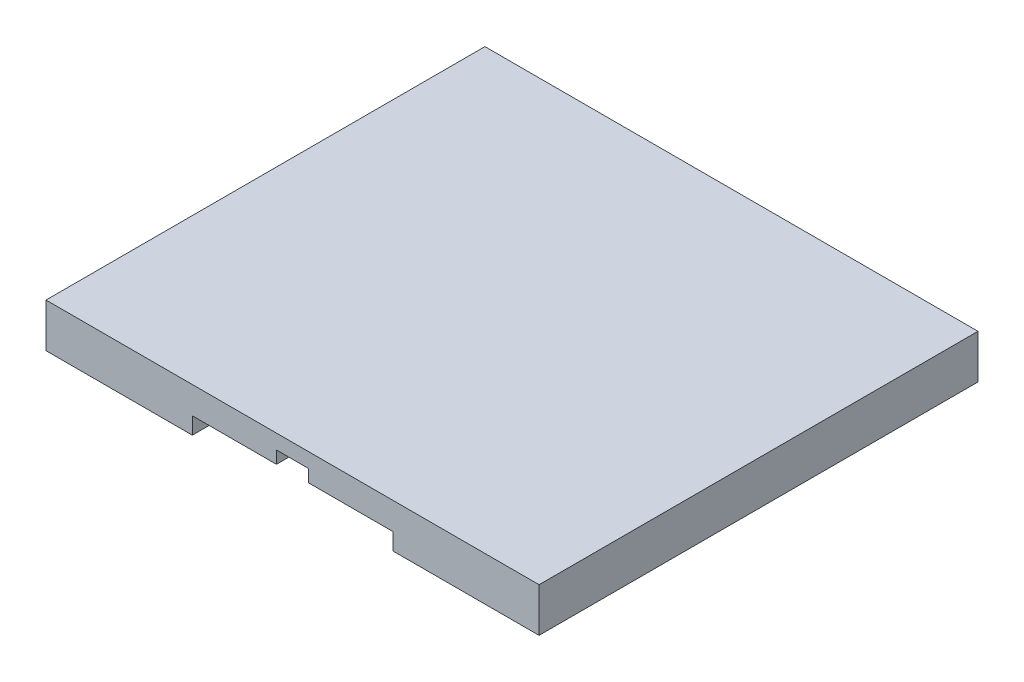
ISO-10303-21;
HEADER;
FILE_DESCRIPTION(('STEP AP214'),'2;1');
FILE_NAME('part.step','',(''),(''),'','','');
FILE_SCHEMA(('AUTOMOTIVE_DESIGN { 1 0 10303 214 1 1 1 1 }'));
ENDSEC;
DATA;
#1=APPLICATION_CONTEXT('core data for automotive mechanical design processes');
#2=APPLICATION_PROTOCOL_DEFINITION('international standard','automotive_design',2000,#1);
#3=PRODUCT_CONTEXT('',#1,'mechanical');
#4=PRODUCT('Part','Part','',(#3));
#5=PRODUCT_RELATED_PRODUCT_CATEGORY('part','',(#4));
#6=PRODUCT_DEFINITION_FORMATION('','',#4);
#7=PRODUCT_DEFINITION_CONTEXT('part definition',#1,'design');
#8=PRODUCT_DEFINITION('design','',#6,#7);
#9=PRODUCT_DEFINITION_SHAPE('','',#8);
#10=(LENGTH_UNIT() NAMED_UNIT(*) SI_UNIT(.MILLI.,.METRE.));
#11=(NAMED_UNIT(*) PLANE_ANGLE_UNIT() SI_UNIT($,.RADIAN.));
#12=(NAMED_UNIT(*) SI_UNIT($,.STERADIAN.) SOLID_ANGLE_UNIT());
#13=UNCERTAINTY_MEASURE_WITH_UNIT(LENGTH_MEASURE(1.E-05),#10,'distance_accuracy_value','');
#14=(GEOMETRIC_REPRESENTATION_CONTEXT(3) GLOBAL_UNCERTAINTY_ASSIGNED_CONTEXT((#13)) GLOBAL_UNIT_ASSIGNED_CONTEXT((#10,
#11,#12)) REPRESENTATION_CONTEXT('',''));
#15=CARTESIAN_POINT('',(0.,0.,0.));
#16=DIRECTION('',(0.,0.,1.));
#17=DIRECTION('',(1.,0.,0.));
#18=AXIS2_PLACEMENT_3D('',#15,#16,#17);
#19=CARTESIAN_POINT('',(100.,481.186214328408,0.));
#20=DIRECTION('',(-1.,0.,0.));
#21=DIRECTION('',(0.,0.,1.));
#22=AXIS2_PLACEMENT_3D('',#19,#20,#21);
#23=PLANE('',#22);
#24=DIRECTION('',(0.,-1.,0.));
#25=VECTOR('',#24,1.);
#26=CARTESIAN_POINT('',(100.,481.186214328408,-101.));
#27=LINE('',#26,#25);
#28=CARTESIAN_POINT('',(100.,11.5,-101.));
#29=VERTEX_POINT('',#28);
#30=CARTESIAN_POINT('',(100.,0.,-101.));
#31=VERTEX_POINT('',#30);
#32=EDGE_CURVE('E263',#29,#31,#27,.T.);
#33=ORIENTED_EDGE('',*,*,#32,.F.);
#34=DIRECTION('',(0.,0.,1.));
#35=VECTOR('',#34,1.);
#36=CARTESIAN_POINT('',(100.,11.5,0.));
#37=LINE('',#36,#35);
#38=CARTESIAN_POINT('',(100.,11.5,0.));
#39=VERTEX_POINT('',#38);
#40=EDGE_CURVE('E408',#29,#39,#37,.T.);
#41=ORIENTED_EDGE('',*,*,#40,.T.);
#42=DIRECTION('',(0.,-1.,0.));
#43=VECTOR('',#42,1.);
#44=CARTESIAN_POINT('',(100.,481.186214328408,0.));
#45=LINE('',#44,#43);
#46=CARTESIAN_POINT('',(100.,0.,0.));
#47=VERTEX_POINT('',#46);
#48=EDGE_CURVE('E268',#39,#47,#45,.T.);
#49=ORIENTED_EDGE('',*,*,#48,.T.);
#50=DIRECTION('',(0.,0.,-1.));
#51=VECTOR('',#50,1.);
#52=CARTESIAN_POINT('',(100.,0.,0.));
#53=LINE('',#52,#51);
#54=EDGE_CURVE('E264',#47,#31,#53,.T.);
#55=ORIENTED_EDGE('',*,*,#54,.T.);
#56=EDGE_LOOP('',(#33,#41,#49,#55));
#57=FACE_BOUND('',#56,.T.);
#58=ADVANCED_FACE('F45',(#57),#23,.F.);
#59=CARTESIAN_POINT('',(100.,481.186214328408,-101.));
#60=DIRECTION('',(0.,0.,-1.));
#61=DIRECTION('',(-1.,0.,0.));
#62=AXIS2_PLACEMENT_3D('',#59,#60,#61);
#63=PLANE('',#62);
#64=DIRECTION('',(-1.,0.,0.));
#65=VECTOR('',#64,1.);
#66=CARTESIAN_POINT('',(179.5,11.5,-101.));
#67=LINE('',#66,#65);
#68=CARTESIAN_POINT('',(237.,11.5,-101.));
#69=VERTEX_POINT('',#68);
#70=CARTESIAN_POINT('',(179.5,11.5,-101.));
#71=VERTEX_POINT('',#70);
#72=EDGE_CURVE('E385',#69,#71,#67,.T.);
#73=ORIENTED_EDGE('',*,*,#72,.T.);
#74=DIRECTION('',(0.,1.,0.));
#75=VECTOR('',#74,1.);
#76=CARTESIAN_POINT('',(179.5,11.5,-101.));
#77=LINE('',#76,#75);
#78=CARTESIAN_POINT('',(179.5,20.,-101.));
#79=VERTEX_POINT('',#78);
#80=EDGE_CURVE('E379',#71,#79,#77,.T.);
#81=ORIENTED_EDGE('',*,*,#80,.T.);
#82=DIRECTION('',(-1.,0.,0.));
#83=VECTOR('',#82,1.);
#84=CARTESIAN_POINT('',(100.,20.,-101.));
#85=LINE('',#84,#83);
#86=CARTESIAN_POINT('',(157.5,20.,-101.));
#87=VERTEX_POINT('',#86);
#88=EDGE_CURVE('E214',#79,#87,#85,.T.);
#89=ORIENTED_EDGE('',*,*,#88,.T.);
#90=DIRECTION('',(0.,1.,0.));
#91=VECTOR('',#90,1.);
#92=CARTESIAN_POINT('',(157.5,11.5,-101.));
#93=LINE('',#92,#91);
#94=CARTESIAN_POINT('',(157.5,11.5,-101.));
#95=VERTEX_POINT('',#94);
#96=EDGE_CURVE('E427',#95,#87,#93,.T.);
#97=ORIENTED_EDGE('',*,*,#96,.F.);
#98=DIRECTION('',(-1.,0.,0.));
#99=VECTOR('',#98,1.);
#100=CARTESIAN_POINT('',(100.,11.5,-101.));
#101=LINE('',#100,#99);
#102=EDGE_CURVE('E419',#95,#29,#101,.T.);
#103=ORIENTED_EDGE('',*,*,#102,.T.);
#104=ORIENTED_EDGE('',*,*,#32,.T.);
#105=DIRECTION('',(1.,0.,0.));
#106=VECTOR('',#105,1.);
#107=CARTESIAN_POINT('',(100.,0.,-101.));
#108=LINE('',#107,#106);
#109=CARTESIAN_POINT('',(237.,0.,-101.));
#110=VERTEX_POINT('',#109);
#111=EDGE_CURVE('E259',#31,#110,#108,.T.);
#112=ORIENTED_EDGE('',*,*,#111,.T.);
#113=DIRECTION('',(0.,-1.,0.));
#114=VECTOR('',#113,1.);
#115=CARTESIAN_POINT('',(237.,481.186214328408,-101.));
#116=LINE('',#115,#114);
#117=EDGE_CURVE('E258',#69,#110,#116,.T.);
#118=ORIENTED_EDGE('',*,*,#117,.F.);
#119=EDGE_LOOP('',(#73,#81,#89,#97,#103,#104,#112,#118));
#120=FACE_BOUND('',#119,.T.);
#121=ADVANCED_FACE('F437',(#120),#63,.F.);
#122=CARTESIAN_POINT('',(237.,481.186214328408,0.));
#123=DIRECTION('',(1.,0.,0.));
#124=DIRECTION('',(0.,0.,-1.));
#125=AXIS2_PLACEMENT_3D('',#122,#123,#124);
#126=PLANE('',#125);
#127=DIRECTION('',(0.,-1.,0.));
#128=VECTOR('',#127,1.);
#129=CARTESIAN_POINT('',(237.,481.186214328408,0.));
#130=LINE('',#129,#128);
#131=CARTESIAN_POINT('',(237.,11.5,0.));
#132=VERTEX_POINT('',#131);
#133=CARTESIAN_POINT('',(237.,0.,0.));
#134=VERTEX_POINT('',#133);
#135=EDGE_CURVE('E253',#132,#134,#130,.T.);
#136=ORIENTED_EDGE('',*,*,#135,.F.);
#137=DIRECTION('',(0.,0.,-1.));
#138=VECTOR('',#137,1.);
#139=CARTESIAN_POINT('',(237.,11.5,0.));
#140=LINE('',#139,#138);
#141=EDGE_CURVE('E398',#132,#69,#140,.T.);
#142=ORIENTED_EDGE('',*,*,#141,.T.);
#143=ORIENTED_EDGE('',*,*,#117,.T.);
#144=DIRECTION('',(0.,0.,1.));
#145=VECTOR('',#144,1.);
#146=CARTESIAN_POINT('',(237.,0.,0.));
#147=LINE('',#146,#145);
#148=EDGE_CURVE('E254',#110,#134,#147,.T.);
#149=ORIENTED_EDGE('',*,*,#148,.T.);
#150=EDGE_LOOP('',(#136,#142,#143,#149));
#151=FACE_BOUND('',#150,.T.);
#152=ADVANCED_FACE('F454',(#151),#126,.F.);
#153=CARTESIAN_POINT('',(237.,481.186214328408,-199.));
#154=DIRECTION('',(1.,0.,0.));
#155=DIRECTION('',(0.,0.,-1.));
#156=AXIS2_PLACEMENT_3D('',#153,#154,#155);
#157=PLANE('',#156);
#158=DIRECTION('',(0.,-1.,0.));
#159=VECTOR('',#158,1.);
#160=CARTESIAN_POINT('',(237.,481.186214328408,-199.));
#161=LINE('',#160,#159);
#162=CARTESIAN_POINT('',(237.,11.5,-199.));
#163=VERTEX_POINT('',#162);
#164=CARTESIAN_POINT('',(237.,0.,-199.));
#165=VERTEX_POINT('',#164);
#166=EDGE_CURVE('E233',#163,#165,#161,.T.);
#167=ORIENTED_EDGE('',*,*,#166,.F.);
#168=DIRECTION('',(0.,0.,-1.));
#169=VECTOR('',#168,1.);
#170=CARTESIAN_POINT('',(237.,11.5,-199.));
#171=LINE('',#170,#169);
#172=CARTESIAN_POINT('',(237.,11.5,-300.));
#173=VERTEX_POINT('',#172);
#174=EDGE_CURVE('E350',#163,#173,#171,.T.);
#175=ORIENTED_EDGE('',*,*,#174,.T.);
#176=DIRECTION('',(0.,-1.,0.));
#177=VECTOR('',#176,1.);
#178=CARTESIAN_POINT('',(237.,481.186214328408,-300.));
#179=LINE('',#178,#177);
#180=CARTESIAN_POINT('',(237.,0.,-300.));
#181=VERTEX_POINT('',#180);
#182=EDGE_CURVE('E238',#173,#181,#179,.T.);
#183=ORIENTED_EDGE('',*,*,#182,.T.);
#184=DIRECTION('',(0.,0.,1.));
#185=VECTOR('',#184,1.);
#186=CARTESIAN_POINT('',(237.,0.,-199.));
#187=LINE('',#186,#185);
#188=EDGE_CURVE('E234',#181,#165,#187,.T.);
#189=ORIENTED_EDGE('',*,*,#188,.T.);
#190=EDGE_LOOP('',(#167,#175,#183,#189));
#191=FACE_BOUND('',#190,.T.);
#192=ADVANCED_FACE('F349',(#191),#157,.F.);
#193=CARTESIAN_POINT('',(100.,481.186214328408,-199.));
#194=DIRECTION('',(0.,0.,1.));
#195=DIRECTION('',(1.,0.,0.));
#196=AXIS2_PLACEMENT_3D('',#193,#194,#195);
#197=PLANE('',#196);
#198=DIRECTION('',(1.,0.,0.));
#199=VECTOR('',#198,1.);
#200=CARTESIAN_POINT('',(100.,20.,-199.));
#201=LINE('',#200,#199);
#202=CARTESIAN_POINT('',(157.5,20.,-199.));
#203=VERTEX_POINT('',#202);
#204=CARTESIAN_POINT('',(179.,20.,-199.));
#205=VERTEX_POINT('',#204);
#206=EDGE_CURVE('E199',#203,#205,#201,.T.);
#207=ORIENTED_EDGE('',*,*,#206,.T.);
#208=DIRECTION('',(0.,1.,0.));
#209=VECTOR('',#208,1.);
#210=CARTESIAN_POINT('',(179.,11.5,-199.));
#211=LINE('',#210,#209);
#212=CARTESIAN_POINT('',(179.,11.5,-199.));
#213=VERTEX_POINT('',#212);
#214=EDGE_CURVE('E184',#213,#205,#211,.T.);
#215=ORIENTED_EDGE('',*,*,#214,.F.);
#216=DIRECTION('',(1.,0.,0.));
#217=VECTOR('',#216,1.);
#218=CARTESIAN_POINT('',(179.,11.5,-199.));
#219=LINE('',#218,#217);
#220=EDGE_CURVE('E353',#213,#163,#219,.T.);
#221=ORIENTED_EDGE('',*,*,#220,.T.);
#222=ORIENTED_EDGE('',*,*,#166,.T.);
#223=DIRECTION('',(-1.,0.,0.));
#224=VECTOR('',#223,1.);
#225=CARTESIAN_POINT('',(100.,0.,-199.));
#226=LINE('',#225,#224);
#227=CARTESIAN_POINT('',(100.,0.,-199.));
#228=VERTEX_POINT('',#227);
#229=EDGE_CURVE('E229',#165,#228,#226,.T.);
#230=ORIENTED_EDGE('',*,*,#229,.T.);
#231=DIRECTION('',(0.,-1.,0.));
#232=VECTOR('',#231,1.);
#233=CARTESIAN_POINT('',(100.,481.186214328408,-199.));
#234=LINE('',#233,#232);
#235=CARTESIAN_POINT('',(100.,11.5,-199.));
#236=VERTEX_POINT('',#235);
#237=EDGE_CURVE('E228',#236,#228,#234,.T.);
#238=ORIENTED_EDGE('',*,*,#237,.F.);
#239=DIRECTION('',(1.,0.,0.));
#240=VECTOR('',#239,1.);
#241=CARTESIAN_POINT('',(100.,11.5,-199.));
#242=LINE('',#241,#240);
#243=CARTESIAN_POINT('',(157.5,11.5,-199.));
#244=VERTEX_POINT('',#243);
#245=EDGE_CURVE('E365',#236,#244,#242,.T.);
#246=ORIENTED_EDGE('',*,*,#245,.T.);
#247=DIRECTION('',(0.,1.,0.));
#248=VECTOR('',#247,1.);
#249=CARTESIAN_POINT('',(157.5,11.5,-199.));
#250=LINE('',#249,#248);
#251=EDGE_CURVE('E206',#244,#203,#250,.T.);
#252=ORIENTED_EDGE('',*,*,#251,.T.);
#253=EDGE_LOOP('',(#207,#215,#221,#222,#230,#238,#246,#252));
#254=FACE_BOUND('',#253,.T.);
#255=ADVANCED_FACE('F204',(#254),#197,.F.);
#256=CARTESIAN_POINT('',(100.,481.186214328408,-199.));
#257=DIRECTION('',(-1.,0.,0.));
#258=DIRECTION('',(0.,0.,1.));
#259=AXIS2_PLACEMENT_3D('',#256,#257,#258);
#260=PLANE('',#259);
#261=DIRECTION('',(0.,-1.,0.));
#262=VECTOR('',#261,1.);
#263=CARTESIAN_POINT('',(100.,481.186214328408,-300.));
#264=LINE('',#263,#262);
#265=CARTESIAN_POINT('',(100.,11.5,-300.));
#266=VERTEX_POINT('',#265);
#267=CARTESIAN_POINT('',(100.,0.,-300.));
#268=VERTEX_POINT('',#267);
#269=EDGE_CURVE('E223',#266,#268,#264,.T.);
#270=ORIENTED_EDGE('',*,*,#269,.F.);
#271=DIRECTION('',(0.,0.,1.));
#272=VECTOR('',#271,1.);
#273=CARTESIAN_POINT('',(100.,11.5,-199.));
#274=LINE('',#273,#272);
#275=EDGE_CURVE('E362',#266,#236,#274,.T.);
#276=ORIENTED_EDGE('',*,*,#275,.T.);
#277=ORIENTED_EDGE('',*,*,#237,.T.);
#278=DIRECTION('',(0.,0.,-1.));
#279=VECTOR('',#278,1.);
#280=CARTESIAN_POINT('',(100.,0.,-199.));
#281=LINE('',#280,#279);
#282=EDGE_CURVE('E224',#228,#268,#281,.T.);
#283=ORIENTED_EDGE('',*,*,#282,.T.);
#284=EDGE_LOOP('',(#270,#276,#277,#283));
#285=FACE_BOUND('',#284,.T.);
#286=ADVANCED_FACE('F318',(#285),#260,.F.);
#287=CARTESIAN_POINT('',(0.,481.186214328408,0.));
#288=DIRECTION('',(1.,0.,0.));
#289=DIRECTION('',(0.,0.,-1.));
#290=AXIS2_PLACEMENT_3D('',#287,#288,#289);
#291=PLANE('',#290);
#292=DIRECTION('',(0.,0.,1.));
#293=VECTOR('',#292,1.);
#294=CARTESIAN_POINT('',(0.,30.,0.));
#295=LINE('',#294,#293);
#296=CARTESIAN_POINT('',(0.,30.,-300.));
#297=VERTEX_POINT('',#296);
#298=CARTESIAN_POINT('',(0.,30.,0.));
#299=VERTEX_POINT('',#298);
#300=EDGE_CURVE('E280',#297,#299,#295,.T.);
#301=ORIENTED_EDGE('',*,*,#300,.F.);
#302=DIRECTION('',(0.,-1.,0.));
#303=VECTOR('',#302,1.);
#304=CARTESIAN_POINT('',(0.,481.186214328408,-300.));
#305=LINE('',#304,#303);
#306=CARTESIAN_POINT('',(0.,0.,-300.));
#307=VERTEX_POINT('',#306);
#308=EDGE_CURVE('E49',#297,#307,#305,.T.);
#309=ORIENTED_EDGE('',*,*,#308,.T.);
#310=DIRECTION('',(0.,0.,1.));
#311=VECTOR('',#310,1.);
#312=CARTESIAN_POINT('',(0.,0.,0.));
#313=LINE('',#312,#311);
#314=CARTESIAN_POINT('',(0.,0.,0.));
#315=VERTEX_POINT('',#314);
#316=EDGE_CURVE('E274',#307,#315,#313,.T.);
#317=ORIENTED_EDGE('',*,*,#316,.T.);
#318=DIRECTION('',(0.,-1.,0.));
#319=VECTOR('',#318,1.);
#320=CARTESIAN_POINT('',(0.,481.186214328408,0.));
#321=LINE('',#320,#319);
#322=EDGE_CURVE('E273',#299,#315,#321,.T.);
#323=ORIENTED_EDGE('',*,*,#322,.F.);
#324=EDGE_LOOP('',(#301,#309,#317,#323));
#325=FACE_BOUND('',#324,.T.);
#326=ADVANCED_FACE('F328',(#325),#291,.F.);
#327=CARTESIAN_POINT('',(0.,481.186214328408,0.));
#328=DIRECTION('',(0.,0.,-1.));
#329=DIRECTION('',(-1.,0.,0.));
#330=AXIS2_PLACEMENT_3D('',#327,#328,#329);
#331=PLANE('',#330);
#332=DIRECTION('',(1.,0.,0.));
#333=VECTOR('',#332,1.);
#334=CARTESIAN_POINT('',(179.5,11.5,0.));
#335=LINE('',#334,#333);
#336=CARTESIAN_POINT('',(179.5,11.5,0.));
#337=VERTEX_POINT('',#336);
#338=EDGE_CURVE('E402',#337,#132,#335,.T.);
#339=ORIENTED_EDGE('',*,*,#338,.T.);
#340=ORIENTED_EDGE('',*,*,#135,.T.);
#341=DIRECTION('',(1.,0.,0.));
#342=VECTOR('',#341,1.);
#343=CARTESIAN_POINT('',(237.,0.,0.));
#344=LINE('',#343,#342);
#345=CARTESIAN_POINT('',(337.,0.,0.));
#346=VERTEX_POINT('',#345);
#347=EDGE_CURVE('E249',#134,#346,#344,.T.);
#348=ORIENTED_EDGE('',*,*,#347,.T.);
#349=DIRECTION('',(0.,-1.,0.));
#350=VECTOR('',#349,1.);
#351=CARTESIAN_POINT('',(337.,481.186214328408,0.));
#352=LINE('',#351,#350);
#353=CARTESIAN_POINT('',(337.,30.,0.));
#354=VERTEX_POINT('',#353);
#355=EDGE_CURVE('E248',#354,#346,#352,.T.);
#356=ORIENTED_EDGE('',*,*,#355,.F.);
#357=DIRECTION('',(1.,0.,0.));
#358=VECTOR('',#357,1.);
#359=CARTESIAN_POINT('',(0.,30.,0.));
#360=LINE('',#359,#358);
#361=EDGE_CURVE('E55',#299,#354,#360,.T.);
#362=ORIENTED_EDGE('',*,*,#361,.F.);
#363=ORIENTED_EDGE('',*,*,#322,.T.);
#364=DIRECTION('',(1.,0.,0.));
#365=VECTOR('',#364,1.);
#366=CARTESIAN_POINT('',(0.,0.,0.));
#367=LINE('',#366,#365);
#368=EDGE_CURVE('E269',#315,#47,#367,.T.);
#369=ORIENTED_EDGE('',*,*,#368,.T.);
#370=ORIENTED_EDGE('',*,*,#48,.F.);
#371=DIRECTION('',(1.,0.,0.));
#372=VECTOR('',#371,1.);
#373=CARTESIAN_POINT('',(100.,11.5,0.));
#374=LINE('',#373,#372);
#375=CARTESIAN_POINT('',(157.5,11.5,0.));
#376=VERTEX_POINT('',#375);
#377=EDGE_CURVE('E412',#39,#376,#374,.T.);
#378=ORIENTED_EDGE('',*,*,#377,.T.);
#379=DIRECTION('',(0.,1.,0.));
#380=VECTOR('',#379,1.);
#381=CARTESIAN_POINT('',(157.5,11.5,0.));
#382=LINE('',#381,#380);
#383=CARTESIAN_POINT('',(157.5,20.,0.));
#384=VERTEX_POINT('',#383);
#385=EDGE_CURVE('E423',#376,#384,#382,.T.);
#386=ORIENTED_EDGE('',*,*,#385,.T.);
#387=DIRECTION('',(1.,0.,0.));
#388=VECTOR('',#387,1.);
#389=CARTESIAN_POINT('',(100.,20.,0.));
#390=LINE('',#389,#388);
#391=CARTESIAN_POINT('',(179.5,20.,0.));
#392=VERTEX_POINT('',#391);
#393=EDGE_CURVE('E208',#384,#392,#390,.T.);
#394=ORIENTED_EDGE('',*,*,#393,.T.);
#395=DIRECTION('',(0.,1.,0.));
#396=VECTOR('',#395,1.);
#397=CARTESIAN_POINT('',(179.5,11.5,0.));
#398=LINE('',#397,#396);
#399=EDGE_CURVE('E382',#337,#392,#398,.T.);
#400=ORIENTED_EDGE('',*,*,#399,.F.);
#401=EDGE_LOOP('',(#339,#340,#348,#356,#362,#363,#369,#370,#378,#386,#394,#400));
#402=FACE_BOUND('',#401,.T.);
#403=ADVANCED_FACE('F340',(#402),#331,.F.);
#404=CARTESIAN_POINT('',(337.,481.186214328408,0.));
#405=DIRECTION('',(-1.,0.,0.));
#406=DIRECTION('',(0.,0.,1.));
#407=AXIS2_PLACEMENT_3D('',#404,#405,#406);
#408=PLANE('',#407);
#409=DIRECTION('',(0.,0.,-1.));
#410=VECTOR('',#409,1.);
#411=CARTESIAN_POINT('',(337.,30.,0.));
#412=LINE('',#411,#410);
#413=CARTESIAN_POINT('',(337.,30.,-300.));
#414=VERTEX_POINT('',#413);
#415=EDGE_CURVE('E11',#354,#414,#412,.T.);
#416=ORIENTED_EDGE('',*,*,#415,.F.);
#417=ORIENTED_EDGE('',*,*,#355,.T.);
#418=DIRECTION('',(0.,0.,-1.));
#419=VECTOR('',#418,1.);
#420=CARTESIAN_POINT('',(337.,0.,0.));
#421=LINE('',#420,#419);
#422=CARTESIAN_POINT('',(337.,0.,-300.));
#423=VERTEX_POINT('',#422);
#424=EDGE_CURVE('E244',#346,#423,#421,.T.);
#425=ORIENTED_EDGE('',*,*,#424,.T.);
#426=DIRECTION('',(0.,-1.,0.));
#427=VECTOR('',#426,1.);
#428=CARTESIAN_POINT('',(337.,481.186214328408,-300.));
#429=LINE('',#428,#427);
#430=EDGE_CURVE('E243',#414,#423,#429,.T.);
#431=ORIENTED_EDGE('',*,*,#430,.F.);
#432=EDGE_LOOP('',(#416,#417,#425,#431));
#433=FACE_BOUND('',#432,.T.);
#434=ADVANCED_FACE('F334',(#433),#408,.F.);
#435=CARTESIAN_POINT('',(237.,481.186214328408,-300.));
#436=DIRECTION('',(0.,0.,1.));
#437=DIRECTION('',(1.,0.,0.));
#438=AXIS2_PLACEMENT_3D('',#435,#436,#437);
#439=PLANE('',#438);
#440=ORIENTED_EDGE('',*,*,#182,.F.);
#441=DIRECTION('',(-1.,0.,0.));
#442=VECTOR('',#441,1.);
#443=CARTESIAN_POINT('',(179.,11.5,-300.));
#444=LINE('',#443,#442);
#445=CARTESIAN_POINT('',(179.,11.5,-300.));
#446=VERTEX_POINT('',#445);
#447=EDGE_CURVE('E192',#173,#446,#444,.T.);
#448=ORIENTED_EDGE('',*,*,#447,.T.);
#449=DIRECTION('',(0.,1.,0.));
#450=VECTOR('',#449,1.);
#451=CARTESIAN_POINT('',(179.,11.5,-300.));
#452=LINE('',#451,#450);
#453=CARTESIAN_POINT('',(179.,20.,-300.));
#454=VERTEX_POINT('',#453);
#455=EDGE_CURVE('E193',#446,#454,#452,.T.);
#456=ORIENTED_EDGE('',*,*,#455,.T.);
#457=DIRECTION('',(-1.,0.,0.));
#458=VECTOR('',#457,1.);
#459=CARTESIAN_POINT('',(100.,20.,-300.));
#460=LINE('',#459,#458);
#461=CARTESIAN_POINT('',(157.5,20.,-300.));
#462=VERTEX_POINT('',#461);
#463=EDGE_CURVE('E70',#454,#462,#460,.T.);
#464=ORIENTED_EDGE('',*,*,#463,.T.);
#465=DIRECTION('',(0.,1.,0.));
#466=VECTOR('',#465,1.);
#467=CARTESIAN_POINT('',(157.5,11.5,-300.));
#468=LINE('',#467,#466);
#469=CARTESIAN_POINT('',(157.5,11.5,-300.));
#470=VERTEX_POINT('',#469);
#471=EDGE_CURVE('E376',#470,#462,#468,.T.);
#472=ORIENTED_EDGE('',*,*,#471,.F.);
#473=DIRECTION('',(-1.,0.,0.));
#474=VECTOR('',#473,1.);
#475=CARTESIAN_POINT('',(100.,11.5,-300.));
#476=LINE('',#475,#474);
#477=EDGE_CURVE('E314',#470,#266,#476,.T.);
#478=ORIENTED_EDGE('',*,*,#477,.T.);
#479=ORIENTED_EDGE('',*,*,#269,.T.);
#480=DIRECTION('',(-1.,0.,0.));
#481=VECTOR('',#480,1.);
#482=CARTESIAN_POINT('',(0.,0.,-300.));
#483=LINE('',#482,#481);
#484=EDGE_CURVE('E218',#268,#307,#483,.T.);
#485=ORIENTED_EDGE('',*,*,#484,.T.);
#486=ORIENTED_EDGE('',*,*,#308,.F.);
#487=DIRECTION('',(-1.,0.,0.));
#488=VECTOR('',#487,1.);
#489=CARTESIAN_POINT('',(0.,30.,-300.));
#490=LINE('',#489,#488);
#491=EDGE_CURVE('E222',#414,#297,#490,.T.);
#492=ORIENTED_EDGE('',*,*,#491,.F.);
#493=ORIENTED_EDGE('',*,*,#430,.T.);
#494=DIRECTION('',(-1.,0.,0.));
#495=VECTOR('',#494,1.);
#496=CARTESIAN_POINT('',(237.,0.,-300.));
#497=LINE('',#496,#495);
#498=EDGE_CURVE('E239',#423,#181,#497,.T.);
#499=ORIENTED_EDGE('',*,*,#498,.T.);
#500=EDGE_LOOP('',(#440,#448,#456,#464,#472,#478,#479,#485,#486,#492,#493,#499));
#501=FACE_BOUND('',#500,.T.);
#502=ADVANCED_FACE('F310',(#501),#439,.F.);
#503=CARTESIAN_POINT('',(0.,0.,0.));
#504=DIRECTION('',(0.,-1.,0.));
#505=DIRECTION('',(0.,0.,-1.));
#506=AXIS2_PLACEMENT_3D('',#503,#504,#505);
#507=PLANE('',#506);
#508=ORIENTED_EDGE('',*,*,#316,.F.);
#509=ORIENTED_EDGE('',*,*,#484,.F.);
#510=ORIENTED_EDGE('',*,*,#282,.F.);
#511=ORIENTED_EDGE('',*,*,#229,.F.);
#512=ORIENTED_EDGE('',*,*,#188,.F.);
#513=ORIENTED_EDGE('',*,*,#498,.F.);
#514=ORIENTED_EDGE('',*,*,#424,.F.);
#515=ORIENTED_EDGE('',*,*,#347,.F.);
#516=ORIENTED_EDGE('',*,*,#148,.F.);
#517=ORIENTED_EDGE('',*,*,#111,.F.);
#518=ORIENTED_EDGE('',*,*,#54,.F.);
#519=ORIENTED_EDGE('',*,*,#368,.F.);
#520=EDGE_LOOP('',(#508,#509,#510,#511,#512,#513,#514,#515,#516,#517,#518,#519));
#521=FACE_BOUND('',#520,.T.);
#522=ADVANCED_FACE('F322',(#521),#507,.T.);
#523=CARTESIAN_POINT('',(0.,30.,0.));
#524=DIRECTION('',(0.,1.,0.));
#525=DIRECTION('',(0.,0.,1.));
#526=AXIS2_PLACEMENT_3D('',#523,#524,#525);
#527=PLANE('',#526);
#528=ORIENTED_EDGE('',*,*,#415,.T.);
#529=ORIENTED_EDGE('',*,*,#491,.T.);
#530=ORIENTED_EDGE('',*,*,#300,.T.);
#531=ORIENTED_EDGE('',*,*,#361,.T.);
#532=EDGE_LOOP('',(#528,#529,#530,#531));
#533=FACE_BOUND('',#532,.T.);
#534=ADVANCED_FACE('F47',(#533),#527,.T.);
#535=CARTESIAN_POINT('',(0.,20.,0.));
#536=DIRECTION('',(0.,1.,0.));
#537=DIRECTION('',(0.,0.,1.));
#538=AXIS2_PLACEMENT_3D('',#535,#536,#537);
#539=PLANE('',#538);
#540=ORIENTED_EDGE('',*,*,#463,.F.);
#541=DIRECTION('',(0.,0.,1.));
#542=VECTOR('',#541,1.);
#543=CARTESIAN_POINT('',(179.,20.,-199.));
#544=LINE('',#543,#542);
#545=EDGE_CURVE('E63',#454,#205,#544,.T.);
#546=ORIENTED_EDGE('',*,*,#545,.T.);
#547=ORIENTED_EDGE('',*,*,#206,.F.);
#548=DIRECTION('',(0.,0.,-1.));
#549=VECTOR('',#548,1.);
#550=CARTESIAN_POINT('',(157.5,20.,-199.));
#551=LINE('',#550,#549);
#552=EDGE_CURVE('E201',#203,#462,#551,.T.);
#553=ORIENTED_EDGE('',*,*,#552,.T.);
#554=EDGE_LOOP('',(#540,#546,#547,#553));
#555=FACE_BOUND('',#554,.T.);
#556=ADVANCED_FACE('F197',(#555),#539,.F.);
#557=CARTESIAN_POINT('',(0.,20.,0.));
#558=DIRECTION('',(0.,1.,0.));
#559=DIRECTION('',(0.,0.,1.));
#560=AXIS2_PLACEMENT_3D('',#557,#558,#559);
#561=PLANE('',#560);
#562=ORIENTED_EDGE('',*,*,#88,.F.);
#563=DIRECTION('',(0.,0.,1.));
#564=VECTOR('',#563,1.);
#565=CARTESIAN_POINT('',(179.5,20.,0.));
#566=LINE('',#565,#564);
#567=EDGE_CURVE('E389',#79,#392,#566,.T.);
#568=ORIENTED_EDGE('',*,*,#567,.T.);
#569=ORIENTED_EDGE('',*,*,#393,.F.);
#570=DIRECTION('',(0.,0.,-1.));
#571=VECTOR('',#570,1.);
#572=CARTESIAN_POINT('',(157.5,20.,0.));
#573=LINE('',#572,#571);
#574=EDGE_CURVE('E393',#384,#87,#573,.T.);
#575=ORIENTED_EDGE('',*,*,#574,.T.);
#576=EDGE_LOOP('',(#562,#568,#569,#575));
#577=FACE_BOUND('',#576,.T.);
#578=ADVANCED_FACE('F444',(#577),#561,.F.);
#579=CARTESIAN_POINT('',(157.5,11.5,0.));
#580=DIRECTION('',(1.,0.,0.));
#581=DIRECTION('',(0.,0.,-1.));
#582=AXIS2_PLACEMENT_3D('',#579,#580,#581);
#583=PLANE('',#582);
#584=ORIENTED_EDGE('',*,*,#574,.F.);
#585=ORIENTED_EDGE('',*,*,#385,.F.);
#586=DIRECTION('',(0.,0.,-1.));
#587=VECTOR('',#586,1.);
#588=CARTESIAN_POINT('',(157.5,11.5,0.));
#589=LINE('',#588,#587);
#590=EDGE_CURVE('E416',#376,#95,#589,.T.);
#591=ORIENTED_EDGE('',*,*,#590,.T.);
#592=ORIENTED_EDGE('',*,*,#96,.T.);
#593=EDGE_LOOP('',(#584,#585,#591,#592));
#594=FACE_BOUND('',#593,.T.);
#595=ADVANCED_FACE('F440',(#594),#583,.T.);
#596=CARTESIAN_POINT('',(0.,11.5,0.));
#597=DIRECTION('',(0.,-1.,0.));
#598=DIRECTION('',(0.,0.,-1.));
#599=AXIS2_PLACEMENT_3D('',#596,#597,#598);
#600=PLANE('',#599);
#601=CARTESIAN_POINT('',(147.499999999999,11.5,-8.50000000000002));
#602=DIRECTION('',(0.,-1.,0.));
#603=DIRECTION('',(0.,0.,-1.));
#604=AXIS2_PLACEMENT_3D('',#601,#602,#603);
#605=CIRCLE('',#604,2.5);
#606=CARTESIAN_POINT('',(147.499999999999,11.5,-11.));
#607=VERTEX_POINT('',#606);
#608=EDGE_CURVE('E809',#607,#607,#605,.T.);
#609=ORIENTED_EDGE('',*,*,#608,.F.);
#610=EDGE_LOOP('',(#609));
#611=FACE_BOUND('',#610,.T.);
#612=CARTESIAN_POINT('',(147.5,11.5,-92.5));
#613=DIRECTION('',(0.,-1.,0.));
#614=DIRECTION('',(0.,0.,-1.));
#615=AXIS2_PLACEMENT_3D('',#612,#613,#614);
#616=CIRCLE('',#615,2.5);
#617=CARTESIAN_POINT('',(147.5,11.5,-95.));
#618=VERTEX_POINT('',#617);
#619=EDGE_CURVE('E813',#618,#618,#616,.T.);
#620=ORIENTED_EDGE('',*,*,#619,.F.);
#621=EDGE_LOOP('',(#620));
#622=FACE_BOUND('',#621,.T.);
#623=ORIENTED_EDGE('',*,*,#40,.F.);
#624=ORIENTED_EDGE('',*,*,#102,.F.);
#625=ORIENTED_EDGE('',*,*,#590,.F.);
#626=ORIENTED_EDGE('',*,*,#377,.F.);
#627=EDGE_LOOP('',(#623,#624,#625,#626));
#628=FACE_BOUND('',#627,.T.);
#629=ADVANCED_FACE('F448',(#611,#622,#628),#600,.T.);
#630=CARTESIAN_POINT('',(179.5,11.5,0.));
#631=DIRECTION('',(-1.,0.,0.));
#632=DIRECTION('',(0.,0.,1.));
#633=AXIS2_PLACEMENT_3D('',#630,#631,#632);
#634=PLANE('',#633);
#635=ORIENTED_EDGE('',*,*,#567,.F.);
#636=ORIENTED_EDGE('',*,*,#80,.F.);
#637=DIRECTION('',(0.,0.,1.));
#638=VECTOR('',#637,1.);
#639=CARTESIAN_POINT('',(179.5,11.5,0.));
#640=LINE('',#639,#638);
#641=EDGE_CURVE('E394',#71,#337,#640,.T.);
#642=ORIENTED_EDGE('',*,*,#641,.T.);
#643=ORIENTED_EDGE('',*,*,#399,.T.);
#644=EDGE_LOOP('',(#635,#636,#642,#643));
#645=FACE_BOUND('',#644,.T.);
#646=ADVANCED_FACE('F459',(#645),#634,.T.);
#647=CARTESIAN_POINT('',(0.,11.5,0.));
#648=DIRECTION('',(0.,-1.,0.));
#649=DIRECTION('',(0.,0.,-1.));
#650=AXIS2_PLACEMENT_3D('',#647,#648,#649);
#651=PLANE('',#650);
#652=CARTESIAN_POINT('',(189.499999999999,11.5,-8.50000000000004));
#653=DIRECTION('',(0.,-1.,0.));
#654=DIRECTION('',(0.,0.,-1.));
#655=AXIS2_PLACEMENT_3D('',#652,#653,#654);
#656=CIRCLE('',#655,2.5);
#657=CARTESIAN_POINT('',(189.499999999999,11.5,-11.));
#658=VERTEX_POINT('',#657);
#659=EDGE_CURVE('E794',#658,#658,#656,.T.);
#660=ORIENTED_EDGE('',*,*,#659,.F.);
#661=EDGE_LOOP('',(#660));
#662=FACE_BOUND('',#661,.T.);
#663=CARTESIAN_POINT('',(189.5,11.5,-92.5));
#664=DIRECTION('',(0.,-1.,0.));
#665=DIRECTION('',(0.,0.,-1.));
#666=AXIS2_PLACEMENT_3D('',#663,#664,#665);
#667=CIRCLE('',#666,2.5);
#668=CARTESIAN_POINT('',(189.5,11.5,-95.));
#669=VERTEX_POINT('',#668);
#670=EDGE_CURVE('E798',#669,#669,#667,.T.);
#671=ORIENTED_EDGE('',*,*,#670,.F.);
#672=EDGE_LOOP('',(#671));
#673=FACE_BOUND('',#672,.T.);
#674=ORIENTED_EDGE('',*,*,#641,.F.);
#675=ORIENTED_EDGE('',*,*,#72,.F.);
#676=ORIENTED_EDGE('',*,*,#141,.F.);
#677=ORIENTED_EDGE('',*,*,#338,.F.);
#678=EDGE_LOOP('',(#674,#675,#676,#677));
#679=FACE_BOUND('',#678,.T.);
#680=ADVANCED_FACE('F457',(#662,#673,#679),#651,.T.);
#681=CARTESIAN_POINT('',(157.5,11.5,-199.));
#682=DIRECTION('',(1.,0.,0.));
#683=DIRECTION('',(0.,0.,-1.));
#684=AXIS2_PLACEMENT_3D('',#681,#682,#683);
#685=PLANE('',#684);
#686=ORIENTED_EDGE('',*,*,#552,.F.);
#687=ORIENTED_EDGE('',*,*,#251,.F.);
#688=DIRECTION('',(0.,0.,-1.));
#689=VECTOR('',#688,1.);
#690=CARTESIAN_POINT('',(157.5,11.5,-199.));
#691=LINE('',#690,#689);
#692=EDGE_CURVE('E368',#244,#470,#691,.T.);
#693=ORIENTED_EDGE('',*,*,#692,.T.);
#694=ORIENTED_EDGE('',*,*,#471,.T.);
#695=EDGE_LOOP('',(#686,#687,#693,#694));
#696=FACE_BOUND('',#695,.T.);
#697=ADVANCED_FACE('F467',(#696),#685,.T.);
#698=CARTESIAN_POINT('',(0.,11.5,0.));
#699=DIRECTION('',(0.,-1.,0.));
#700=DIRECTION('',(0.,0.,-1.));
#701=AXIS2_PLACEMENT_3D('',#698,#699,#700);
#702=PLANE('',#701);
#703=CARTESIAN_POINT('',(147.499999999999,11.5,-207.5));
#704=DIRECTION('',(0.,-1.,0.));
#705=DIRECTION('',(0.,0.,-1.));
#706=AXIS2_PLACEMENT_3D('',#703,#704,#705);
#707=CIRCLE('',#706,2.5);
#708=CARTESIAN_POINT('',(147.499999999999,11.5,-210.));
#709=VERTEX_POINT('',#708);
#710=EDGE_CURVE('E782',#709,#709,#707,.T.);
#711=ORIENTED_EDGE('',*,*,#710,.F.);
#712=EDGE_LOOP('',(#711));
#713=FACE_BOUND('',#712,.T.);
#714=CARTESIAN_POINT('',(147.5,11.5,-291.5));
#715=DIRECTION('',(0.,-1.,0.));
#716=DIRECTION('',(0.,0.,-1.));
#717=AXIS2_PLACEMENT_3D('',#714,#715,#716);
#718=CIRCLE('',#717,2.5);
#719=CARTESIAN_POINT('',(147.5,11.5,-294.));
#720=VERTEX_POINT('',#719);
#721=EDGE_CURVE('E764',#720,#720,#718,.T.);
#722=ORIENTED_EDGE('',*,*,#721,.F.);
#723=EDGE_LOOP('',(#722));
#724=FACE_BOUND('',#723,.T.);
#725=ORIENTED_EDGE('',*,*,#275,.F.);
#726=ORIENTED_EDGE('',*,*,#477,.F.);
#727=ORIENTED_EDGE('',*,*,#692,.F.);
#728=ORIENTED_EDGE('',*,*,#245,.F.);
#729=EDGE_LOOP('',(#725,#726,#727,#728));
#730=FACE_BOUND('',#729,.T.);
#731=ADVANCED_FACE('F568',(#713,#724,#730),#702,.T.);
#732=CARTESIAN_POINT('',(179.,11.5,-199.));
#733=DIRECTION('',(-1.,0.,0.));
#734=DIRECTION('',(0.,0.,1.));
#735=AXIS2_PLACEMENT_3D('',#732,#733,#734);
#736=PLANE('',#735);
#737=ORIENTED_EDGE('',*,*,#545,.F.);
#738=ORIENTED_EDGE('',*,*,#455,.F.);
#739=DIRECTION('',(0.,0.,1.));
#740=VECTOR('',#739,1.);
#741=CARTESIAN_POINT('',(179.,11.5,-199.));
#742=LINE('',#741,#740);
#743=EDGE_CURVE('E187',#446,#213,#742,.T.);
#744=ORIENTED_EDGE('',*,*,#743,.T.);
#745=ORIENTED_EDGE('',*,*,#214,.T.);
#746=EDGE_LOOP('',(#737,#738,#744,#745));
#747=FACE_BOUND('',#746,.T.);
#748=ADVANCED_FACE('F185',(#747),#736,.T.);
#749=CARTESIAN_POINT('',(0.,11.5,0.));
#750=DIRECTION('',(0.,-1.,0.));
#751=DIRECTION('',(0.,0.,-1.));
#752=AXIS2_PLACEMENT_3D('',#749,#750,#751);
#753=PLANE('',#752);
#754=CARTESIAN_POINT('',(189.5,11.5,-207.5));
#755=DIRECTION('',(0.,-1.,0.));
#756=DIRECTION('',(0.,0.,-1.));
#757=AXIS2_PLACEMENT_3D('',#754,#755,#756);
#758=CIRCLE('',#757,2.5);
#759=CARTESIAN_POINT('',(189.5,11.5,-210.));
#760=VERTEX_POINT('',#759);
#761=EDGE_CURVE('E759',#760,#760,#758,.T.);
#762=ORIENTED_EDGE('',*,*,#761,.F.);
#763=EDGE_LOOP('',(#762));
#764=FACE_BOUND('',#763,.T.);
#765=CARTESIAN_POINT('',(189.500000000001,11.5,-291.5));
#766=DIRECTION('',(0.,-1.,0.));
#767=DIRECTION('',(0.,0.,-1.));
#768=AXIS2_PLACEMENT_3D('',#765,#766,#767);
#769=CIRCLE('',#768,2.5);
#770=CARTESIAN_POINT('',(189.500000000001,11.5,-294.));
#771=VERTEX_POINT('',#770);
#772=EDGE_CURVE('E767',#771,#771,#769,.T.);
#773=ORIENTED_EDGE('',*,*,#772,.F.);
#774=EDGE_LOOP('',(#773));
#775=FACE_BOUND('',#774,.T.);
#776=ORIENTED_EDGE('',*,*,#743,.F.);
#777=ORIENTED_EDGE('',*,*,#447,.F.);
#778=ORIENTED_EDGE('',*,*,#174,.F.);
#779=ORIENTED_EDGE('',*,*,#220,.F.);
#780=EDGE_LOOP('',(#776,#777,#778,#779));
#781=FACE_BOUND('',#780,.T.);
#782=ADVANCED_FACE('F587',(#764,#775,#781),#753,.T.);
#783=CARTESIAN_POINT('',(147.5,19.5,-92.5));
#784=DIRECTION('',(0.,-1.,0.));
#785=DIRECTION('',(0.,0.,-1.));
#786=AXIS2_PLACEMENT_3D('',#783,#784,#785);
#787=CYLINDRICAL_SURFACE('',#786,2.5);
#788=CARTESIAN_POINT('',(147.5,19.5,-92.5));
#789=DIRECTION('',(0.,-1.,0.));
#790=DIRECTION('',(0.,0.,-1.));
#791=AXIS2_PLACEMENT_3D('',#788,#789,#790);
#792=CIRCLE('',#791,2.5);
#793=CARTESIAN_POINT('',(147.5,19.5,-95.));
#794=VERTEX_POINT('',#793);
#795=EDGE_CURVE('E793',#794,#794,#792,.T.);
#796=ORIENTED_EDGE('',*,*,#795,.F.);
#797=EDGE_LOOP('',(#796));
#798=FACE_BOUND('',#797,.T.);
#799=ORIENTED_EDGE('',*,*,#619,.T.);
#800=EDGE_LOOP('',(#799));
#801=FACE_BOUND('',#800,.T.);
#802=ADVANCED_FACE('F596',(#798,#801),#787,.F.);
#803=CARTESIAN_POINT('',(147.5,19.5,-92.5));
#804=DIRECTION('',(0.,-1.,0.));
#805=DIRECTION('',(0.,0.,-1.));
#806=AXIS2_PLACEMENT_3D('',#803,#804,#805);
#807=PLANE('',#806);
#808=ORIENTED_EDGE('',*,*,#795,.T.);
#809=EDGE_LOOP('',(#808));
#810=FACE_BOUND('',#809,.T.);
#811=ADVANCED_FACE('F607',(#810),#807,.T.);
#812=CARTESIAN_POINT('',(147.499999999999,19.5,-8.50000000000002));
#813=DIRECTION('',(0.,-1.,0.));
#814=DIRECTION('',(0.,0.,-1.));
#815=AXIS2_PLACEMENT_3D('',#812,#813,#814);
#816=CYLINDRICAL_SURFACE('',#815,2.5);
#817=CARTESIAN_POINT('',(147.499999999999,19.5,-8.50000000000002));
#818=DIRECTION('',(0.,-1.,0.));
#819=DIRECTION('',(0.,0.,-1.));
#820=AXIS2_PLACEMENT_3D('',#817,#818,#819);
#821=CIRCLE('',#820,2.5);
#822=CARTESIAN_POINT('',(147.499999999999,19.5,-11.));
#823=VERTEX_POINT('',#822);
#824=EDGE_CURVE('E805',#823,#823,#821,.T.);
#825=ORIENTED_EDGE('',*,*,#824,.F.);
#826=EDGE_LOOP('',(#825));
#827=FACE_BOUND('',#826,.T.);
#828=ORIENTED_EDGE('',*,*,#608,.T.);
#829=EDGE_LOOP('',(#828));
#830=FACE_BOUND('',#829,.T.);
#831=ADVANCED_FACE('F617',(#827,#830),#816,.F.);
#832=CARTESIAN_POINT('',(147.499999999999,19.5,-8.50000000000002));
#833=DIRECTION('',(0.,-1.,0.));
#834=DIRECTION('',(0.,0.,-1.));
#835=AXIS2_PLACEMENT_3D('',#832,#833,#834);
#836=PLANE('',#835);
#837=ORIENTED_EDGE('',*,*,#824,.T.);
#838=EDGE_LOOP('',(#837));
#839=FACE_BOUND('',#838,.T.);
#840=ADVANCED_FACE('F627',(#839),#836,.T.);
#841=CARTESIAN_POINT('',(189.5,19.5,-92.5));
#842=DIRECTION('',(0.,-1.,0.));
#843=DIRECTION('',(0.,0.,-1.));
#844=AXIS2_PLACEMENT_3D('',#841,#842,#843);
#845=CYLINDRICAL_SURFACE('',#844,2.5);
#846=CARTESIAN_POINT('',(189.5,19.5,-92.5));
#847=DIRECTION('',(0.,-1.,0.));
#848=DIRECTION('',(0.,0.,-1.));
#849=AXIS2_PLACEMENT_3D('',#846,#847,#848);
#850=CIRCLE('',#849,2.5);
#851=CARTESIAN_POINT('',(189.5,19.5,-95.));
#852=VERTEX_POINT('',#851);
#853=EDGE_CURVE('E781',#852,#852,#850,.T.);
#854=ORIENTED_EDGE('',*,*,#853,.F.);
#855=EDGE_LOOP('',(#854));
#856=FACE_BOUND('',#855,.T.);
#857=ORIENTED_EDGE('',*,*,#670,.T.);
#858=EDGE_LOOP('',(#857));
#859=FACE_BOUND('',#858,.T.);
#860=ADVANCED_FACE('F636',(#856,#859),#845,.F.);
#861=CARTESIAN_POINT('',(189.5,19.5,-92.5));
#862=DIRECTION('',(0.,-1.,0.));
#863=DIRECTION('',(0.,0.,-1.));
#864=AXIS2_PLACEMENT_3D('',#861,#862,#863);
#865=PLANE('',#864);
#866=ORIENTED_EDGE('',*,*,#853,.T.);
#867=EDGE_LOOP('',(#866));
#868=FACE_BOUND('',#867,.T.);
#869=ADVANCED_FACE('F645',(#868),#865,.T.);
#870=CARTESIAN_POINT('',(189.499999999999,19.5,-8.50000000000004));
#871=DIRECTION('',(0.,-1.,0.));
#872=DIRECTION('',(0.,0.,-1.));
#873=AXIS2_PLACEMENT_3D('',#870,#871,#872);
#874=CYLINDRICAL_SURFACE('',#873,2.5);
#875=CARTESIAN_POINT('',(189.499999999999,19.5,-8.50000000000004));
#876=DIRECTION('',(0.,-1.,0.));
#877=DIRECTION('',(0.,0.,-1.));
#878=AXIS2_PLACEMENT_3D('',#875,#876,#877);
#879=CIRCLE('',#878,2.5);
#880=CARTESIAN_POINT('',(189.499999999999,19.5,-11.));
#881=VERTEX_POINT('',#880);
#882=EDGE_CURVE('E789',#881,#881,#879,.T.);
#883=ORIENTED_EDGE('',*,*,#882,.F.);
#884=EDGE_LOOP('',(#883));
#885=FACE_BOUND('',#884,.T.);
#886=ORIENTED_EDGE('',*,*,#659,.T.);
#887=EDGE_LOOP('',(#886));
#888=FACE_BOUND('',#887,.T.);
#889=ADVANCED_FACE('F655',(#885,#888),#874,.F.);
#890=CARTESIAN_POINT('',(189.499999999999,19.5,-8.50000000000004));
#891=DIRECTION('',(0.,-1.,0.));
#892=DIRECTION('',(0.,0.,-1.));
#893=AXIS2_PLACEMENT_3D('',#890,#891,#892);
#894=PLANE('',#893);
#895=ORIENTED_EDGE('',*,*,#882,.T.);
#896=EDGE_LOOP('',(#895));
#897=FACE_BOUND('',#896,.T.);
#898=ADVANCED_FACE('F665',(#897),#894,.T.);
#899=CARTESIAN_POINT('',(147.5,19.5,-291.5));
#900=DIRECTION('',(0.,-1.,0.));
#901=DIRECTION('',(0.,0.,-1.));
#902=AXIS2_PLACEMENT_3D('',#899,#900,#901);
#903=CYLINDRICAL_SURFACE('',#902,2.5);
#904=CARTESIAN_POINT('',(147.5,19.5,-291.5));
#905=DIRECTION('',(0.,-1.,0.));
#906=DIRECTION('',(0.,0.,-1.));
#907=AXIS2_PLACEMENT_3D('',#904,#905,#906);
#908=CIRCLE('',#907,2.5);
#909=CARTESIAN_POINT('',(147.5,19.5,-294.));
#910=VERTEX_POINT('',#909);
#911=EDGE_CURVE('E758',#910,#910,#908,.T.);
#912=ORIENTED_EDGE('',*,*,#911,.F.);
#913=EDGE_LOOP('',(#912));
#914=FACE_BOUND('',#913,.T.);
#915=ORIENTED_EDGE('',*,*,#721,.T.);
#916=EDGE_LOOP('',(#915));
#917=FACE_BOUND('',#916,.T.);
#918=ADVANCED_FACE('F674',(#914,#917),#903,.F.);
#919=CARTESIAN_POINT('',(147.5,19.5,-291.5));
#920=DIRECTION('',(0.,-1.,0.));
#921=DIRECTION('',(0.,0.,-1.));
#922=AXIS2_PLACEMENT_3D('',#919,#920,#921);
#923=PLANE('',#922);
#924=ORIENTED_EDGE('',*,*,#911,.T.);
#925=EDGE_LOOP('',(#924));
#926=FACE_BOUND('',#925,.T.);
#927=ADVANCED_FACE('F683',(#926),#923,.T.);
#928=CARTESIAN_POINT('',(147.499999999999,19.5,-207.5));
#929=DIRECTION('',(0.,-1.,0.));
#930=DIRECTION('',(0.,0.,-1.));
#931=AXIS2_PLACEMENT_3D('',#928,#929,#930);
#932=CYLINDRICAL_SURFACE('',#931,2.5);
#933=CARTESIAN_POINT('',(147.499999999999,19.5,-207.5));
#934=DIRECTION('',(0.,-1.,0.));
#935=DIRECTION('',(0.,0.,-1.));
#936=AXIS2_PLACEMENT_3D('',#933,#934,#935);
#937=CIRCLE('',#936,2.5);
#938=CARTESIAN_POINT('',(147.499999999999,19.5,-210.));
#939=VERTEX_POINT('',#938);
#940=EDGE_CURVE('E777',#939,#939,#937,.T.);
#941=ORIENTED_EDGE('',*,*,#940,.F.);
#942=EDGE_LOOP('',(#941));
#943=FACE_BOUND('',#942,.T.);
#944=ORIENTED_EDGE('',*,*,#710,.T.);
#945=EDGE_LOOP('',(#944));
#946=FACE_BOUND('',#945,.T.);
#947=ADVANCED_FACE('F693',(#943,#946),#932,.F.);
#948=CARTESIAN_POINT('',(147.499999999999,19.5,-207.5));
#949=DIRECTION('',(0.,-1.,0.));
#950=DIRECTION('',(0.,0.,-1.));
#951=AXIS2_PLACEMENT_3D('',#948,#949,#950);
#952=PLANE('',#951);
#953=ORIENTED_EDGE('',*,*,#940,.T.);
#954=EDGE_LOOP('',(#953));
#955=FACE_BOUND('',#954,.T.);
#956=ADVANCED_FACE('F703',(#955),#952,.T.);
#957=CARTESIAN_POINT('',(189.500000000001,19.5,-291.5));
#958=DIRECTION('',(0.,-1.,0.));
#959=DIRECTION('',(0.,0.,-1.));
#960=AXIS2_PLACEMENT_3D('',#957,#958,#959);
#961=CYLINDRICAL_SURFACE('',#960,2.5);
#962=CARTESIAN_POINT('',(189.500000000001,19.5,-291.5));
#963=DIRECTION('',(0.,-1.,0.));
#964=DIRECTION('',(0.,0.,-1.));
#965=AXIS2_PLACEMENT_3D('',#962,#963,#964);
#966=CIRCLE('',#965,2.5);
#967=CARTESIAN_POINT('',(189.500000000001,19.5,-294.));
#968=VERTEX_POINT('',#967);
#969=EDGE_CURVE('E773',#968,#968,#966,.T.);
#970=ORIENTED_EDGE('',*,*,#969,.F.);
#971=EDGE_LOOP('',(#970));
#972=FACE_BOUND('',#971,.T.);
#973=ORIENTED_EDGE('',*,*,#772,.T.);
#974=EDGE_LOOP('',(#973));
#975=FACE_BOUND('',#974,.T.);
#976=ADVANCED_FACE('F712',(#972,#975),#961,.F.);
#977=CARTESIAN_POINT('',(189.500000000001,19.5,-291.5));
#978=DIRECTION('',(0.,-1.,0.));
#979=DIRECTION('',(0.,0.,-1.));
#980=AXIS2_PLACEMENT_3D('',#977,#978,#979);
#981=PLANE('',#980);
#982=ORIENTED_EDGE('',*,*,#969,.T.);
#983=EDGE_LOOP('',(#982));
#984=FACE_BOUND('',#983,.T.);
#985=ADVANCED_FACE('F721',(#984),#981,.T.);
#986=CARTESIAN_POINT('',(189.5,19.5,-207.5));
#987=DIRECTION('',(0.,-1.,0.));
#988=DIRECTION('',(0.,0.,-1.));
#989=AXIS2_PLACEMENT_3D('',#986,#987,#988);
#990=CYLINDRICAL_SURFACE('',#989,2.5);
#991=CARTESIAN_POINT('',(189.5,19.5,-207.5));
#992=DIRECTION('',(0.,-1.,0.));
#993=DIRECTION('',(0.,0.,-1.));
#994=AXIS2_PLACEMENT_3D('',#991,#992,#993);
#995=CIRCLE('',#994,2.5);
#996=CARTESIAN_POINT('',(189.5,19.5,-210.));
#997=VERTEX_POINT('',#996);
#998=EDGE_CURVE('E756',#997,#997,#995,.T.);
#999=ORIENTED_EDGE('',*,*,#998,.F.);
#1000=EDGE_LOOP('',(#999));
#1001=FACE_BOUND('',#1000,.T.);
#1002=ORIENTED_EDGE('',*,*,#761,.T.);
#1003=EDGE_LOOP('',(#1002));
#1004=FACE_BOUND('',#1003,.T.);
#1005=ADVANCED_FACE('F731',(#1001,#1004),#990,.F.);
#1006=CARTESIAN_POINT('',(189.5,19.5,-207.5));
#1007=DIRECTION('',(0.,-1.,0.));
#1008=DIRECTION('',(0.,0.,-1.));
#1009=AXIS2_PLACEMENT_3D('',#1006,#1007,#1008);
#1010=PLANE('',#1009);
#1011=ORIENTED_EDGE('',*,*,#998,.T.);
#1012=EDGE_LOOP('',(#1011));
#1013=FACE_BOUND('',#1012,.T.);
#1014=ADVANCED_FACE('F741',(#1013),#1010,.T.);
#1015=CLOSED_SHELL('',(#58,#121,#152,#192,#255,#286,#326,#403,#434,#502,#522,#534,#556,#578,
#595,#629,#646,#680,#697,#731,#748,#782,#802,#811,#831,#840,#860,#869,#889,#898,#918,#927,#947,
#956,#976,#985,#1005,#1014));
#1016=MANIFOLD_SOLID_BREP('B2',#1015);
#1017=ADVANCED_BREP_SHAPE_REPRESENTATION('',(#18,#1016),#14);
#1018=SHAPE_DEFINITION_REPRESENTATION(#9,#1017);
ENDSEC;
END-ISO-10303-21;
